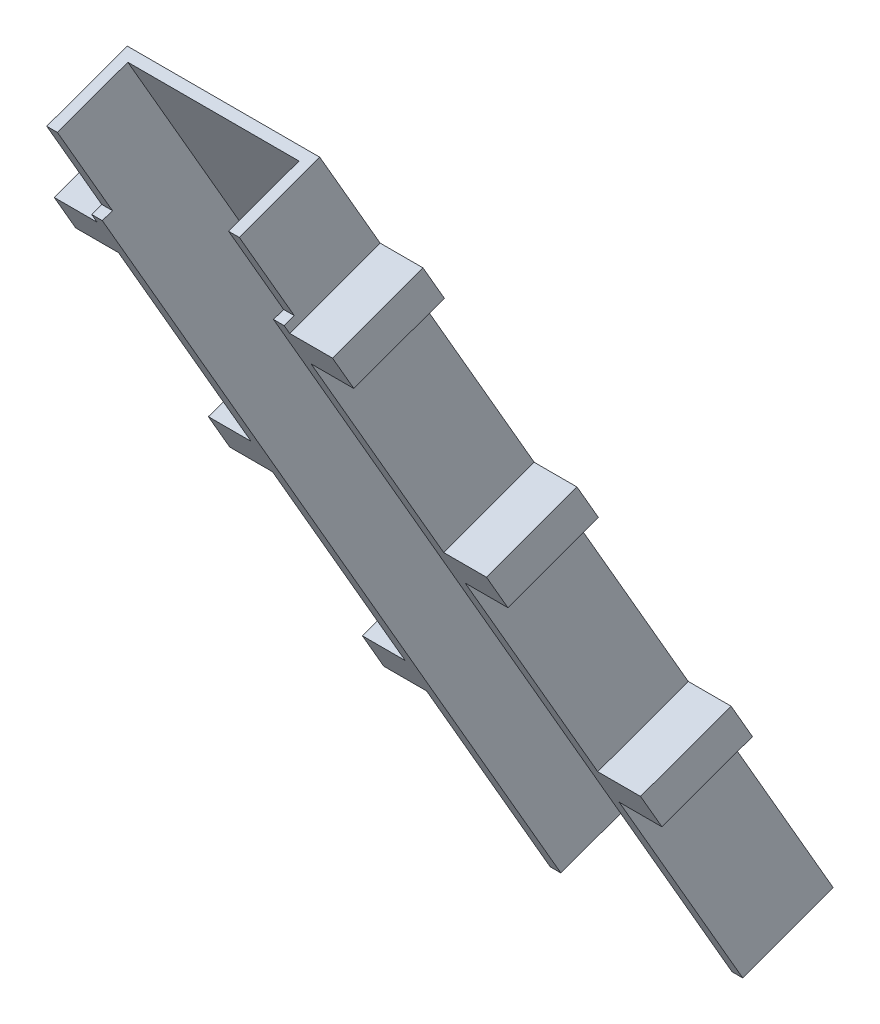
ISO-10303-21;
HEADER;
FILE_DESCRIPTION(('STEP AP214'),'2;1');
FILE_NAME('part.step','',(''),(''),'','','');
FILE_SCHEMA(('AUTOMOTIVE_DESIGN { 1 0 10303 214 1 1 1 1 }'));
ENDSEC;
DATA;
#1=APPLICATION_CONTEXT('core data for automotive mechanical design processes');
#2=APPLICATION_PROTOCOL_DEFINITION('international standard','automotive_design',2000,#1);
#3=PRODUCT_CONTEXT('',#1,'mechanical');
#4=PRODUCT('Part','Part','',(#3));
#5=PRODUCT_RELATED_PRODUCT_CATEGORY('part','',(#4));
#6=PRODUCT_DEFINITION_FORMATION('','',#4);
#7=PRODUCT_DEFINITION_CONTEXT('part definition',#1,'design');
#8=PRODUCT_DEFINITION('design','',#6,#7);
#9=PRODUCT_DEFINITION_SHAPE('','',#8);
#10=(LENGTH_UNIT() NAMED_UNIT(*) SI_UNIT(.MILLI.,.METRE.));
#11=(NAMED_UNIT(*) PLANE_ANGLE_UNIT() SI_UNIT($,.RADIAN.));
#12=(NAMED_UNIT(*) SI_UNIT($,.STERADIAN.) SOLID_ANGLE_UNIT());
#13=UNCERTAINTY_MEASURE_WITH_UNIT(LENGTH_MEASURE(1.E-05),#10,'distance_accuracy_value','');
#14=(GEOMETRIC_REPRESENTATION_CONTEXT(3) GLOBAL_UNCERTAINTY_ASSIGNED_CONTEXT((#13)) GLOBAL_UNIT_ASSIGNED_CONTEXT((#10,
#11,#12)) REPRESENTATION_CONTEXT('',''));
#15=CARTESIAN_POINT('',(0.,0.,0.));
#16=DIRECTION('',(0.,0.,1.));
#17=DIRECTION('',(1.,0.,0.));
#18=AXIS2_PLACEMENT_3D('',#15,#16,#17);
#19=CARTESIAN_POINT('',(0.,0.,0.));
#20=DIRECTION('',(-1.,0.,0.));
#21=DIRECTION('',(0.,0.,1.));
#22=AXIS2_PLACEMENT_3D('',#19,#20,#21);
#23=PLANE('',#22);
#24=DIRECTION('',(0.,0.866025403784438,0.5));
#25=VECTOR('',#24,1.);
#26=CARTESIAN_POINT('',(0.,118.941146080449,65.0602259220047));
#27=LINE('',#26,#25);
#28=CARTESIAN_POINT('',(0.,77.9504405484296,41.3942310488204));
#29=VERTEX_POINT('',#28);
#30=CARTESIAN_POINT('',(0.,112.045860695423,61.0792310488204));
#31=VERTEX_POINT('',#30);
#32=EDGE_CURVE('E671',#29,#31,#27,.T.);
#33=ORIENTED_EDGE('',*,*,#32,.T.);
#34=DIRECTION('',(0.,0.342020143325667,-0.939692620785909));
#35=VECTOR('',#34,1.);
#36=CARTESIAN_POINT('',(0.,116.932473493188,47.6533727293417));
#37=LINE('',#36,#35);
#38=CARTESIAN_POINT('',(0.,116.932473493188,47.6533727293417));
#39=VERTEX_POINT('',#38);
#40=EDGE_CURVE('E281',#31,#39,#37,.T.);
#41=ORIENTED_EDGE('',*,*,#40,.T.);
#42=DIRECTION('',(0.,0.866025403784438,0.500000000000001));
#43=VECTOR('',#42,1.);
#44=CARTESIAN_POINT('',(0.,137.954798289573,59.7906176095263));
#45=LINE('',#44,#43);
#46=CARTESIAN_POINT('',(0.,82.8370533461951,27.9683727293417));
#47=VERTEX_POINT('',#46);
#48=EDGE_CURVE('E667',#47,#39,#45,.T.);
#49=ORIENTED_EDGE('',*,*,#48,.F.);
#50=DIRECTION('',(0.,-0.342020143325669,0.939692620785908));
#51=VECTOR('',#50,1.);
#52=CARTESIAN_POINT('',(0.,77.9504405484296,41.3942310488204));
#53=LINE('',#52,#51);
#54=EDGE_CURVE('E308',#47,#29,#53,.T.);
#55=ORIENTED_EDGE('',*,*,#54,.T.);
#56=EDGE_LOOP('',(#33,#41,#49,#55));
#57=FACE_BOUND('',#56,.T.);
#58=ADVANCED_FACE('F34',(#57),#23,.T.);
#59=CARTESIAN_POINT('',(0.,122.43173480722,50.8283727293417));
#60=VERTEX_POINT('',#59);
#61=CARTESIAN_POINT('',(0.,137.954798289573,59.7906176095263));
#62=VERTEX_POINT('',#61);
#63=EDGE_CURVE('E516',#60,#62,#45,.T.);
#64=ORIENTED_EDGE('',*,*,#63,.F.);
#65=DIRECTION('',(0.,-0.342020143325668,0.939692620785909));
#66=VECTOR('',#65,1.);
#67=CARTESIAN_POINT('',(0.,117.545122009454,64.2542310488204));
#68=LINE('',#67,#66);
#69=CARTESIAN_POINT('',(0.,117.545122009454,64.2542310488204));
#70=VERTEX_POINT('',#69);
#71=EDGE_CURVE('E291',#60,#70,#68,.T.);
#72=ORIENTED_EDGE('',*,*,#71,.T.);
#73=CARTESIAN_POINT('',(0.,118.941146080449,65.0602259220047));
#74=VERTEX_POINT('',#73);
#75=EDGE_CURVE('E442',#70,#74,#27,.T.);
#76=ORIENTED_EDGE('',*,*,#75,.T.);
#77=DIRECTION('',(0.,0.342020143325666,-0.939692620785909));
#78=VECTOR('',#77,1.);
#79=CARTESIAN_POINT('',(0.,119.484103057979,63.5684638865073));
#80=LINE('',#79,#78);
#81=CARTESIAN_POINT('',(0.,119.484103057979,63.5684638865073));
#82=VERTEX_POINT('',#81);
#83=EDGE_CURVE('E460',#74,#82,#80,.T.);
#84=ORIENTED_EDGE('',*,*,#83,.T.);
#85=DIRECTION('',(0.,0.866025403784439,0.499999999999999));
#86=VECTOR('',#85,1.);
#87=CARTESIAN_POINT('',(0.,133.611142469337,71.7247138935073));
#88=LINE('',#87,#86);
#89=CARTESIAN_POINT('',(0.,133.611142469337,71.7247138935073));
#90=VERTEX_POINT('',#89);
#91=EDGE_CURVE('E462',#82,#90,#88,.T.);
#92=ORIENTED_EDGE('',*,*,#91,.T.);
#93=DIRECTION('',(0.,-0.342020143325666,0.939692620785909));
#94=VECTOR('',#93,1.);
#95=CARTESIAN_POINT('',(0.,131.982271536748,76.2000000000002));
#96=LINE('',#95,#94);
#97=EDGE_CURVE('E507',#62,#90,#96,.T.);
#98=ORIENTED_EDGE('',*,*,#97,.F.);
#99=EDGE_LOOP('',(#64,#72,#76,#84,#92,#98));
#100=FACE_BOUND('',#99,.T.);
#101=ADVANCED_FACE('F558',(#100),#23,.T.);
#102=CARTESIAN_POINT('',(0.,38.3557590874051,18.5342310488204));
#103=VERTEX_POINT('',#102);
#104=CARTESIAN_POINT('',(0.,72.4511792343985,38.2192310488204));
#105=VERTEX_POINT('',#104);
#106=EDGE_CURVE('E441',#103,#105,#27,.T.);
#107=ORIENTED_EDGE('',*,*,#106,.T.);
#108=DIRECTION('',(0.,0.342020143325669,-0.939692620785908));
#109=VECTOR('',#108,1.);
#110=CARTESIAN_POINT('',(0.,77.337792032164,24.7933727293417));
#111=LINE('',#110,#109);
#112=CARTESIAN_POINT('',(0.,77.337792032164,24.7933727293417));
#113=VERTEX_POINT('',#112);
#114=EDGE_CURVE('E285',#105,#113,#111,.T.);
#115=ORIENTED_EDGE('',*,*,#114,.T.);
#116=CARTESIAN_POINT('',(0.,43.2423718851706,5.10837272934177));
#117=VERTEX_POINT('',#116);
#118=EDGE_CURVE('E520',#117,#113,#45,.T.);
#119=ORIENTED_EDGE('',*,*,#118,.F.);
#120=DIRECTION('',(0.,-0.34202014332567,0.939692620785908));
#121=VECTOR('',#120,1.);
#122=CARTESIAN_POINT('',(0.,38.3557590874051,18.5342310488204));
#123=LINE('',#122,#121);
#124=EDGE_CURVE('E333',#117,#103,#123,.T.);
#125=ORIENTED_EDGE('',*,*,#124,.T.);
#126=EDGE_LOOP('',(#107,#115,#119,#125));
#127=FACE_BOUND('',#126,.T.);
#128=ADVANCED_FACE('F638',(#127),#23,.T.);
#129=CARTESIAN_POINT('',(0.,1.085913955059,-2.98352407099529));
#130=VERTEX_POINT('',#129);
#131=CARTESIAN_POINT('',(0.,32.8564977733739,15.3592310488204));
#132=VERTEX_POINT('',#131);
#133=EDGE_CURVE('E437',#130,#132,#27,.T.);
#134=ORIENTED_EDGE('',*,*,#133,.T.);
#135=DIRECTION('',(0.,0.342020143325669,-0.939692620785908));
#136=VECTOR('',#135,1.);
#137=CARTESIAN_POINT('',(0.,37.7431105711394,1.93337272934176));
#138=LINE('',#137,#136);
#139=CARTESIAN_POINT('',(0.,37.7431105711394,1.93337272934176));
#140=VERTEX_POINT('',#139);
#141=EDGE_CURVE('E328',#132,#140,#138,.T.);
#142=ORIENTED_EDGE('',*,*,#141,.T.);
#143=CARTESIAN_POINT('',(0.,5.97252675282446,-16.409382390474));
#144=VERTEX_POINT('',#143);
#145=EDGE_CURVE('E517',#144,#140,#45,.T.);
#146=ORIENTED_EDGE('',*,*,#145,.F.);
#147=DIRECTION('',(0.,0.342020143325666,-0.939692620785909));
#148=VECTOR('',#147,1.);
#149=CARTESIAN_POINT('',(0.,5.97252675282446,-16.409382390474));
#150=LINE('',#149,#148);
#151=EDGE_CURVE('E503',#130,#144,#150,.T.);
#152=ORIENTED_EDGE('',*,*,#151,.F.);
#153=EDGE_LOOP('',(#134,#142,#146,#152));
#154=FACE_BOUND('',#153,.T.);
#155=ADVANCED_FACE('F634',(#154),#23,.T.);
#156=CARTESIAN_POINT('',(28.575,0.,0.));
#157=DIRECTION('',(-1.,0.,0.));
#158=DIRECTION('',(0.,0.,1.));
#159=AXIS2_PLACEMENT_3D('',#156,#157,#158);
#160=PLANE('',#159);
#161=DIRECTION('',(0.,-0.34202014332567,0.939692620785908));
#162=VECTOR('',#161,1.);
#163=CARTESIAN_POINT('',(28.575,38.3557590874051,18.5342310488204));
#164=LINE('',#163,#162);
#165=CARTESIAN_POINT('',(28.575,43.2423718851706,5.10837272934182));
#166=VERTEX_POINT('',#165);
#167=CARTESIAN_POINT('',(28.575,38.3557590874051,18.5342310488204));
#168=VERTEX_POINT('',#167);
#169=EDGE_CURVE('E360',#166,#168,#164,.T.);
#170=ORIENTED_EDGE('',*,*,#169,.F.);
#171=DIRECTION('',(0.,0.866025403784438,0.500000000000001));
#172=VECTOR('',#171,1.);
#173=CARTESIAN_POINT('',(28.575,137.954798289573,59.7906176095263));
#174=LINE('',#173,#172);
#175=CARTESIAN_POINT('',(28.575,77.337792032164,24.7933727293417));
#176=VERTEX_POINT('',#175);
#177=EDGE_CURVE('E511',#166,#176,#174,.T.);
#178=ORIENTED_EDGE('',*,*,#177,.T.);
#179=DIRECTION('',(0.,0.342020143325669,-0.939692620785908));
#180=VECTOR('',#179,1.);
#181=CARTESIAN_POINT('',(28.575,77.337792032164,24.7933727293417));
#182=LINE('',#181,#180);
#183=CARTESIAN_POINT('',(28.575,72.4511792343985,38.2192310488204));
#184=VERTEX_POINT('',#183);
#185=EDGE_CURVE('E382',#184,#176,#182,.T.);
#186=ORIENTED_EDGE('',*,*,#185,.F.);
#187=DIRECTION('',(0.,0.866025403784438,0.5));
#188=VECTOR('',#187,1.);
#189=CARTESIAN_POINT('',(28.575,118.941146080449,65.0602259220047));
#190=LINE('',#189,#188);
#191=EDGE_CURVE('E446',#168,#184,#190,.T.);
#192=ORIENTED_EDGE('',*,*,#191,.F.);
#193=EDGE_LOOP('',(#170,#178,#186,#192));
#194=FACE_BOUND('',#193,.T.);
#195=ADVANCED_FACE('F599',(#194),#160,.F.);
#196=DIRECTION('',(0.,0.342020143325669,-0.939692620785908));
#197=VECTOR('',#196,1.);
#198=CARTESIAN_POINT('',(28.575,37.7431105711394,1.93337272934176));
#199=LINE('',#198,#197);
#200=CARTESIAN_POINT('',(28.575,32.8564977733739,15.3592310488204));
#201=VERTEX_POINT('',#200);
#202=CARTESIAN_POINT('',(28.575,37.7431105711394,1.93337272934176));
#203=VERTEX_POINT('',#202);
#204=EDGE_CURVE('E355',#201,#203,#199,.T.);
#205=ORIENTED_EDGE('',*,*,#204,.F.);
#206=CARTESIAN_POINT('',(28.575,1.085913955059,-2.98352407099529));
#207=VERTEX_POINT('',#206);
#208=EDGE_CURVE('E443',#207,#201,#190,.T.);
#209=ORIENTED_EDGE('',*,*,#208,.F.);
#210=DIRECTION('',(0.,0.342020143325666,-0.939692620785909));
#211=VECTOR('',#210,1.);
#212=CARTESIAN_POINT('',(28.575,5.97252675282446,-16.409382390474));
#213=LINE('',#212,#211);
#214=CARTESIAN_POINT('',(28.575,5.97252675282446,-16.409382390474));
#215=VERTEX_POINT('',#214);
#216=EDGE_CURVE('E504',#207,#215,#213,.T.);
#217=ORIENTED_EDGE('',*,*,#216,.T.);
#218=EDGE_CURVE('E508',#215,#203,#174,.T.);
#219=ORIENTED_EDGE('',*,*,#218,.T.);
#220=EDGE_LOOP('',(#205,#209,#217,#219));
#221=FACE_BOUND('',#220,.T.);
#222=ADVANCED_FACE('F581',(#221),#160,.F.);
#223=DIRECTION('',(0.,-0.342020143325669,0.939692620785908));
#224=VECTOR('',#223,1.);
#225=CARTESIAN_POINT('',(28.575,77.9504405484296,41.3942310488204));
#226=LINE('',#225,#224);
#227=CARTESIAN_POINT('',(28.575,82.8370533461951,27.9683727293419));
#228=VERTEX_POINT('',#227);
#229=CARTESIAN_POINT('',(28.575,77.9504405484296,41.3942310488204));
#230=VERTEX_POINT('',#229);
#231=EDGE_CURVE('E387',#228,#230,#226,.T.);
#232=ORIENTED_EDGE('',*,*,#231,.F.);
#233=CARTESIAN_POINT('',(28.575,116.932473493188,47.6533727293417));
#234=VERTEX_POINT('',#233);
#235=EDGE_CURVE('E553',#228,#234,#174,.T.);
#236=ORIENTED_EDGE('',*,*,#235,.T.);
#237=DIRECTION('',(0.,0.342020143325667,-0.939692620785909));
#238=VECTOR('',#237,1.);
#239=CARTESIAN_POINT('',(28.575,116.932473493188,47.6533727293417));
#240=LINE('',#239,#238);
#241=CARTESIAN_POINT('',(28.575,112.045860695423,61.0792310488204));
#242=VERTEX_POINT('',#241);
#243=EDGE_CURVE('E409',#242,#234,#240,.T.);
#244=ORIENTED_EDGE('',*,*,#243,.F.);
#245=EDGE_CURVE('E617',#230,#242,#190,.T.);
#246=ORIENTED_EDGE('',*,*,#245,.F.);
#247=EDGE_LOOP('',(#232,#236,#244,#246));
#248=FACE_BOUND('',#247,.T.);
#249=ADVANCED_FACE('F605',(#248),#160,.F.);
#250=DIRECTION('',(0.,-0.342020143325668,0.939692620785909));
#251=VECTOR('',#250,1.);
#252=CARTESIAN_POINT('',(28.575,117.545122009454,64.2542310488204));
#253=LINE('',#252,#251);
#254=CARTESIAN_POINT('',(28.575,122.43173480722,50.828372729342));
#255=VERTEX_POINT('',#254);
#256=CARTESIAN_POINT('',(28.575,117.545122009454,64.2542310488204));
#257=VERTEX_POINT('',#256);
#258=EDGE_CURVE('E414',#255,#257,#253,.T.);
#259=ORIENTED_EDGE('',*,*,#258,.F.);
#260=CARTESIAN_POINT('',(28.575,137.954798289573,59.7906176095263));
#261=VERTEX_POINT('',#260);
#262=EDGE_CURVE('E506',#255,#261,#174,.T.);
#263=ORIENTED_EDGE('',*,*,#262,.T.);
#264=DIRECTION('',(0.,-0.342020143325666,0.939692620785909));
#265=VECTOR('',#264,1.);
#266=CARTESIAN_POINT('',(28.575,131.982271536748,76.2000000000002));
#267=LINE('',#266,#265);
#268=CARTESIAN_POINT('',(28.575,133.611142469337,71.7247138935073));
#269=VERTEX_POINT('',#268);
#270=EDGE_CURVE('E510',#261,#269,#267,.T.);
#271=ORIENTED_EDGE('',*,*,#270,.T.);
#272=DIRECTION('',(0.,0.866025403784439,0.499999999999999));
#273=VECTOR('',#272,1.);
#274=CARTESIAN_POINT('',(28.575,133.611142469337,71.7247138935073));
#275=LINE('',#274,#273);
#276=CARTESIAN_POINT('',(28.575,119.484103057979,63.5684638865073));
#277=VERTEX_POINT('',#276);
#278=EDGE_CURVE('E463',#277,#269,#275,.T.);
#279=ORIENTED_EDGE('',*,*,#278,.F.);
#280=DIRECTION('',(0.,0.342020143325666,-0.939692620785909));
#281=VECTOR('',#280,1.);
#282=CARTESIAN_POINT('',(28.575,119.484103057979,63.5684638865073));
#283=LINE('',#282,#281);
#284=CARTESIAN_POINT('',(28.575,118.941146080449,65.0602259220047));
#285=VERTEX_POINT('',#284);
#286=EDGE_CURVE('E459',#285,#277,#283,.T.);
#287=ORIENTED_EDGE('',*,*,#286,.F.);
#288=EDGE_CURVE('E436',#257,#285,#190,.T.);
#289=ORIENTED_EDGE('',*,*,#288,.F.);
#290=EDGE_LOOP('',(#259,#263,#271,#279,#287,#289));
#291=FACE_BOUND('',#290,.T.);
#292=ADVANCED_FACE('F548',(#291),#160,.F.);
#293=CARTESIAN_POINT('',(28.575,5.97252675282446,-16.409382390474));
#294=DIRECTION('',(0.,0.939692620785909,0.342020143325667));
#295=DIRECTION('',(0.,-0.342020143325667,0.939692620785909));
#296=AXIS2_PLACEMENT_3D('',#293,#294,#295);
#297=PLANE('',#296);
#298=ORIENTED_EDGE('',*,*,#216,.F.);
#299=DIRECTION('',(1.,0.,0.));
#300=VECTOR('',#299,1.);
#301=CARTESIAN_POINT('',(0.,1.085913955059,-2.98352407099529));
#302=LINE('',#301,#300);
#303=CARTESIAN_POINT('',(26.9875,1.085913955059,-2.98352407099529));
#304=VERTEX_POINT('',#303);
#305=EDGE_CURVE('E440',#304,#207,#302,.T.);
#306=ORIENTED_EDGE('',*,*,#305,.F.);
#307=DIRECTION('',(0.,0.342020143325667,-0.939692620785909));
#308=VECTOR('',#307,1.);
#309=CARTESIAN_POINT('',(26.9875,5.97252675282446,-16.409382390474));
#310=LINE('',#309,#308);
#311=CARTESIAN_POINT('',(26.9875,5.42956977529497,-14.9176203549763));
#312=VERTEX_POINT('',#311);
#313=EDGE_CURVE('E493',#304,#312,#310,.T.);
#314=ORIENTED_EDGE('',*,*,#313,.T.);
#315=DIRECTION('',(-1.,0.,0.));
#316=VECTOR('',#315,1.);
#317=CARTESIAN_POINT('',(28.575,5.42956977529497,-14.9176203549763));
#318=LINE('',#317,#316);
#319=CARTESIAN_POINT('',(1.5875,5.42956977529497,-14.9176203549763));
#320=VERTEX_POINT('',#319);
#321=EDGE_CURVE('E497',#312,#320,#318,.T.);
#322=ORIENTED_EDGE('',*,*,#321,.T.);
#323=DIRECTION('',(0.,-0.342020143325667,0.939692620785909));
#324=VECTOR('',#323,1.);
#325=CARTESIAN_POINT('',(1.5875,5.97252675282446,-16.409382390474));
#326=LINE('',#325,#324);
#327=CARTESIAN_POINT('',(1.5875,1.085913955059,-2.98352407099529));
#328=VERTEX_POINT('',#327);
#329=EDGE_CURVE('E500',#320,#328,#326,.T.);
#330=ORIENTED_EDGE('',*,*,#329,.T.);
#331=EDGE_CURVE('E452',#130,#328,#302,.T.);
#332=ORIENTED_EDGE('',*,*,#331,.F.);
#333=ORIENTED_EDGE('',*,*,#151,.T.);
#334=DIRECTION('',(-1.,0.,0.));
#335=VECTOR('',#334,1.);
#336=CARTESIAN_POINT('',(28.575,5.97252675282446,-16.409382390474));
#337=LINE('',#336,#335);
#338=EDGE_CURVE('E525',#215,#144,#337,.T.);
#339=ORIENTED_EDGE('',*,*,#338,.F.);
#340=EDGE_LOOP('',(#298,#306,#314,#322,#330,#332,#333,#339));
#341=FACE_BOUND('',#340,.T.);
#342=ADVANCED_FACE('F36',(#341),#297,.F.);
#343=CARTESIAN_POINT('',(28.575,137.954798289573,59.7906176095263));
#344=DIRECTION('',(0.,-0.500000000000002,0.866025403784438));
#345=DIRECTION('',(0.,-0.866025403784438,-0.500000000000001));
#346=AXIS2_PLACEMENT_3D('',#343,#344,#345);
#347=PLANE('',#346);
#348=ORIENTED_EDGE('',*,*,#145,.T.);
#349=DIRECTION('',(1.,0.,0.));
#350=VECTOR('',#349,1.);
#351=CARTESIAN_POINT('',(-6.35,37.7431105711394,1.93337272934176));
#352=LINE('',#351,#350);
#353=CARTESIAN_POINT('',(-6.35,37.7431105711394,1.93337272934176));
#354=VERTEX_POINT('',#353);
#355=EDGE_CURVE('E350',#354,#140,#352,.T.);
#356=ORIENTED_EDGE('',*,*,#355,.F.);
#357=DIRECTION('',(0.,0.866025403784438,0.500000000000001));
#358=VECTOR('',#357,1.);
#359=CARTESIAN_POINT('',(-6.35,43.2423718851706,5.10837272934177));
#360=LINE('',#359,#358);
#361=CARTESIAN_POINT('',(-6.35,43.2423718851706,5.10837272934177));
#362=VERTEX_POINT('',#361);
#363=EDGE_CURVE('E336',#354,#362,#360,.T.);
#364=ORIENTED_EDGE('',*,*,#363,.T.);
#365=DIRECTION('',(1.,0.,0.));
#366=VECTOR('',#365,1.);
#367=CARTESIAN_POINT('',(-6.35,43.2423718851706,5.10837272934177));
#368=LINE('',#367,#366);
#369=EDGE_CURVE('E347',#362,#117,#368,.T.);
#370=ORIENTED_EDGE('',*,*,#369,.T.);
#371=ORIENTED_EDGE('',*,*,#118,.T.);
#372=DIRECTION('',(1.,0.,0.));
#373=VECTOR('',#372,1.);
#374=CARTESIAN_POINT('',(-6.35,77.337792032164,24.7933727293417));
#375=LINE('',#374,#373);
#376=CARTESIAN_POINT('',(-6.35,77.337792032164,24.7933727293417));
#377=VERTEX_POINT('',#376);
#378=EDGE_CURVE('E323',#377,#113,#375,.T.);
#379=ORIENTED_EDGE('',*,*,#378,.F.);
#380=DIRECTION('',(0.,0.866025403784438,0.500000000000002));
#381=VECTOR('',#380,1.);
#382=CARTESIAN_POINT('',(-6.35,82.8370533461951,27.9683727293417));
#383=LINE('',#382,#381);
#384=CARTESIAN_POINT('',(-6.35,82.8370533461951,27.9683727293417));
#385=VERTEX_POINT('',#384);
#386=EDGE_CURVE('E311',#377,#385,#383,.T.);
#387=ORIENTED_EDGE('',*,*,#386,.T.);
#388=DIRECTION('',(1.,0.,0.));
#389=VECTOR('',#388,1.);
#390=CARTESIAN_POINT('',(-6.35,82.8370533461951,27.9683727293417));
#391=LINE('',#390,#389);
#392=EDGE_CURVE('E320',#385,#47,#391,.T.);
#393=ORIENTED_EDGE('',*,*,#392,.T.);
#394=ORIENTED_EDGE('',*,*,#48,.T.);
#395=DIRECTION('',(1.,0.,0.));
#396=VECTOR('',#395,1.);
#397=CARTESIAN_POINT('',(-6.35,116.932473493188,47.6533727293417));
#398=LINE('',#397,#396);
#399=CARTESIAN_POINT('',(-6.35,116.932473493188,47.6533727293417));
#400=VERTEX_POINT('',#399);
#401=EDGE_CURVE('E286',#400,#39,#398,.T.);
#402=ORIENTED_EDGE('',*,*,#401,.F.);
#403=DIRECTION('',(0.,0.866025403784438,0.500000000000001));
#404=VECTOR('',#403,1.);
#405=CARTESIAN_POINT('',(-6.35,122.43173480722,50.8283727293417));
#406=LINE('',#405,#404);
#407=CARTESIAN_POINT('',(-6.35,122.43173480722,50.8283727293417));
#408=VERTEX_POINT('',#407);
#409=EDGE_CURVE('E273',#400,#408,#406,.T.);
#410=ORIENTED_EDGE('',*,*,#409,.T.);
#411=DIRECTION('',(1.,0.,0.));
#412=VECTOR('',#411,1.);
#413=CARTESIAN_POINT('',(-6.35,122.43173480722,50.8283727293417));
#414=LINE('',#413,#412);
#415=EDGE_CURVE('E300',#408,#60,#414,.T.);
#416=ORIENTED_EDGE('',*,*,#415,.T.);
#417=ORIENTED_EDGE('',*,*,#63,.T.);
#418=DIRECTION('',(-1.,0.,0.));
#419=VECTOR('',#418,1.);
#420=CARTESIAN_POINT('',(28.575,137.954798289573,59.7906176095263));
#421=LINE('',#420,#419);
#422=EDGE_CURVE('E514',#261,#62,#421,.T.);
#423=ORIENTED_EDGE('',*,*,#422,.F.);
#424=ORIENTED_EDGE('',*,*,#262,.F.);
#425=DIRECTION('',(-1.,0.,0.));
#426=VECTOR('',#425,1.);
#427=CARTESIAN_POINT('',(34.925,122.43173480722,50.8283727293417));
#428=LINE('',#427,#426);
#429=CARTESIAN_POINT('',(34.925,122.43173480722,50.8283727293417));
#430=VERTEX_POINT('',#429);
#431=EDGE_CURVE('E427',#430,#255,#428,.T.);
#432=ORIENTED_EDGE('',*,*,#431,.F.);
#433=DIRECTION('',(0.,0.866025403784438,0.500000000000001));
#434=VECTOR('',#433,1.);
#435=CARTESIAN_POINT('',(34.925,122.43173480722,50.8283727293417));
#436=LINE('',#435,#434);
#437=CARTESIAN_POINT('',(34.925,116.932473493188,47.6533727293417));
#438=VERTEX_POINT('',#437);
#439=EDGE_CURVE('E416',#438,#430,#436,.T.);
#440=ORIENTED_EDGE('',*,*,#439,.F.);
#441=DIRECTION('',(-1.,0.,0.));
#442=VECTOR('',#441,1.);
#443=CARTESIAN_POINT('',(34.925,116.932473493188,47.6533727293417));
#444=LINE('',#443,#442);
#445=EDGE_CURVE('E430',#438,#234,#444,.T.);
#446=ORIENTED_EDGE('',*,*,#445,.T.);
#447=ORIENTED_EDGE('',*,*,#235,.F.);
#448=DIRECTION('',(-1.,0.,0.));
#449=VECTOR('',#448,1.);
#450=CARTESIAN_POINT('',(34.925,82.8370533461951,27.9683727293417));
#451=LINE('',#450,#449);
#452=CARTESIAN_POINT('',(34.925,82.8370533461951,27.9683727293417));
#453=VERTEX_POINT('',#452);
#454=EDGE_CURVE('E400',#453,#228,#451,.T.);
#455=ORIENTED_EDGE('',*,*,#454,.F.);
#456=DIRECTION('',(0.,0.866025403784438,0.500000000000002));
#457=VECTOR('',#456,1.);
#458=CARTESIAN_POINT('',(34.925,82.8370533461951,27.9683727293417));
#459=LINE('',#458,#457);
#460=CARTESIAN_POINT('',(34.925,77.337792032164,24.7933727293417));
#461=VERTEX_POINT('',#460);
#462=EDGE_CURVE('E389',#461,#453,#459,.T.);
#463=ORIENTED_EDGE('',*,*,#462,.F.);
#464=DIRECTION('',(-1.,0.,0.));
#465=VECTOR('',#464,1.);
#466=CARTESIAN_POINT('',(34.925,77.337792032164,24.7933727293417));
#467=LINE('',#466,#465);
#468=EDGE_CURVE('E403',#461,#176,#467,.T.);
#469=ORIENTED_EDGE('',*,*,#468,.T.);
#470=ORIENTED_EDGE('',*,*,#177,.F.);
#471=DIRECTION('',(-1.,0.,0.));
#472=VECTOR('',#471,1.);
#473=CARTESIAN_POINT('',(34.925,43.2423718851706,5.10837272934177));
#474=LINE('',#473,#472);
#475=CARTESIAN_POINT('',(34.925,43.2423718851706,5.10837272934177));
#476=VERTEX_POINT('',#475);
#477=EDGE_CURVE('E373',#476,#166,#474,.T.);
#478=ORIENTED_EDGE('',*,*,#477,.F.);
#479=DIRECTION('',(0.,0.866025403784438,0.500000000000001));
#480=VECTOR('',#479,1.);
#481=CARTESIAN_POINT('',(34.925,43.2423718851706,5.10837272934177));
#482=LINE('',#481,#480);
#483=CARTESIAN_POINT('',(34.925,37.7431105711394,1.93337272934176));
#484=VERTEX_POINT('',#483);
#485=EDGE_CURVE('E362',#484,#476,#482,.T.);
#486=ORIENTED_EDGE('',*,*,#485,.F.);
#487=DIRECTION('',(-1.,0.,0.));
#488=VECTOR('',#487,1.);
#489=CARTESIAN_POINT('',(34.925,37.7431105711394,1.93337272934176));
#490=LINE('',#489,#488);
#491=EDGE_CURVE('E376',#484,#203,#490,.T.);
#492=ORIENTED_EDGE('',*,*,#491,.T.);
#493=ORIENTED_EDGE('',*,*,#218,.F.);
#494=ORIENTED_EDGE('',*,*,#338,.T.);
#495=EDGE_LOOP('',(#348,#356,#364,#370,#371,#379,#387,#393,#394,#402,#410,#416,#417,#423,#424,
#432,#440,#446,#447,#455,#463,#469,#470,#478,#486,#492,#493,#494));
#496=FACE_BOUND('',#495,.T.);
#497=ADVANCED_FACE('F554',(#496),#347,.F.);
#498=CARTESIAN_POINT('',(28.575,131.982271536748,76.2000000000002));
#499=DIRECTION('',(0.,-0.939692620785909,-0.342020143325666));
#500=DIRECTION('',(0.,0.342020143325666,-0.939692620785909));
#501=AXIS2_PLACEMENT_3D('',#498,#499,#500);
#502=PLANE('',#501);
#503=ORIENTED_EDGE('',*,*,#97,.T.);
#504=DIRECTION('',(1.,0.,0.));
#505=VECTOR('',#504,1.);
#506=CARTESIAN_POINT('',(0.,133.611142469337,71.7247138935073));
#507=LINE('',#506,#505);
#508=CARTESIAN_POINT('',(1.5875,133.611142469337,71.7247138935073));
#509=VERTEX_POINT('',#508);
#510=EDGE_CURVE('E469',#90,#509,#507,.T.);
#511=ORIENTED_EDGE('',*,*,#510,.T.);
#512=DIRECTION('',(0.,-0.342020143325665,0.93969262078591));
#513=VECTOR('',#512,1.);
#514=CARTESIAN_POINT('',(1.5875,137.411841312043,61.2823796450239));
#515=LINE('',#514,#513);
#516=CARTESIAN_POINT('',(1.5875,137.411841312043,61.2823796450239));
#517=VERTEX_POINT('',#516);
#518=EDGE_CURVE('E482',#517,#509,#515,.T.);
#519=ORIENTED_EDGE('',*,*,#518,.F.);
#520=DIRECTION('',(-1.,0.,0.));
#521=VECTOR('',#520,1.);
#522=CARTESIAN_POINT('',(1.5875,137.411841312043,61.2823796450239));
#523=LINE('',#522,#521);
#524=CARTESIAN_POINT('',(26.9875,137.411841312043,61.2823796450239));
#525=VERTEX_POINT('',#524);
#526=EDGE_CURVE('E487',#525,#517,#523,.T.);
#527=ORIENTED_EDGE('',*,*,#526,.F.);
#528=DIRECTION('',(0.,0.342020143325665,-0.93969262078591));
#529=VECTOR('',#528,1.);
#530=CARTESIAN_POINT('',(26.9875,137.411841312043,61.2823796450239));
#531=LINE('',#530,#529);
#532=CARTESIAN_POINT('',(26.9875,133.611142469337,71.7247138935073));
#533=VERTEX_POINT('',#532);
#534=EDGE_CURVE('E485',#533,#525,#531,.T.);
#535=ORIENTED_EDGE('',*,*,#534,.F.);
#536=EDGE_CURVE('E473',#533,#269,#507,.T.);
#537=ORIENTED_EDGE('',*,*,#536,.T.);
#538=ORIENTED_EDGE('',*,*,#270,.F.);
#539=ORIENTED_EDGE('',*,*,#422,.T.);
#540=EDGE_LOOP('',(#503,#511,#519,#527,#535,#537,#538,#539));
#541=FACE_BOUND('',#540,.T.);
#542=ADVANCED_FACE('F545',(#541),#502,.F.);
#543=CARTESIAN_POINT('',(1.5875,-1.43716705356287,-18.8821327115717));
#544=DIRECTION('',(-1.,0.,0.));
#545=DIRECTION('',(0.,0.,1.));
#546=AXIS2_PLACEMENT_3D('',#543,#544,#545);
#547=PLANE('',#546);
#548=DIRECTION('',(0.,-0.342020143325666,0.939692620785909));
#549=VECTOR('',#548,1.);
#550=CARTESIAN_POINT('',(1.5875,131.83811246638,29.626101997195));
#551=LINE('',#550,#549);
#552=CARTESIAN_POINT('',(1.5875,119.484103057979,63.5684638865073));
#553=VERTEX_POINT('',#552);
#554=CARTESIAN_POINT('',(1.5875,118.941146080449,65.0602259220047));
#555=VERTEX_POINT('',#554);
#556=EDGE_CURVE('E472',#553,#555,#551,.T.);
#557=ORIENTED_EDGE('',*,*,#556,.T.);
#558=DIRECTION('',(0.,-0.866025403784438,-0.5));
#559=VECTOR('',#558,1.);
#560=CARTESIAN_POINT('',(1.5875,-7.6906962851904,-8.0507023557757));
#561=LINE('',#560,#559);
#562=EDGE_CURVE('E456',#555,#328,#561,.T.);
#563=ORIENTED_EDGE('',*,*,#562,.T.);
#564=ORIENTED_EDGE('',*,*,#329,.F.);
#565=DIRECTION('',(0.,0.866025403784438,0.500000000000001));
#566=VECTOR('',#565,1.);
#567=CARTESIAN_POINT('',(1.5875,-1.43716705356287,-18.8821327115717));
#568=LINE('',#567,#566);
#569=EDGE_CURVE('E491',#320,#517,#568,.T.);
#570=ORIENTED_EDGE('',*,*,#569,.T.);
#571=ORIENTED_EDGE('',*,*,#518,.T.);
#572=DIRECTION('',(0.,-0.866025403784439,-0.499999999999999));
#573=VECTOR('',#572,1.);
#574=CARTESIAN_POINT('',(1.5875,-6.90900513123712,-9.40463115024991));
#575=LINE('',#574,#573);
#576=EDGE_CURVE('E479',#509,#553,#575,.T.);
#577=ORIENTED_EDGE('',*,*,#576,.T.);
#578=EDGE_LOOP('',(#557,#563,#564,#570,#571,#577));
#579=FACE_BOUND('',#578,.T.);
#580=ADVANCED_FACE('F566',(#579),#547,.F.);
#581=CARTESIAN_POINT('',(1.5875,-1.43716705356287,-18.8821327115717));
#582=DIRECTION('',(0.,0.500000000000001,-0.866025403784438));
#583=DIRECTION('',(0.,0.866025403784438,0.500000000000002));
#584=AXIS2_PLACEMENT_3D('',#581,#582,#583);
#585=PLANE('',#584);
#586=DIRECTION('',(0.,0.866025403784438,0.500000000000001));
#587=VECTOR('',#586,1.);
#588=CARTESIAN_POINT('',(26.9875,-1.43716705356287,-18.8821327115717));
#589=LINE('',#588,#587);
#590=EDGE_CURVE('E490',#312,#525,#589,.T.);
#591=ORIENTED_EDGE('',*,*,#590,.T.);
#592=ORIENTED_EDGE('',*,*,#526,.T.);
#593=ORIENTED_EDGE('',*,*,#569,.F.);
#594=ORIENTED_EDGE('',*,*,#321,.F.);
#595=EDGE_LOOP('',(#591,#592,#593,#594));
#596=FACE_BOUND('',#595,.T.);
#597=ADVANCED_FACE('F570',(#596),#585,.F.);
#598=CARTESIAN_POINT('',(26.9875,-1.43716705356287,-18.8821327115717));
#599=DIRECTION('',(1.,0.,0.));
#600=DIRECTION('',(0.,0.,-1.));
#601=AXIS2_PLACEMENT_3D('',#598,#599,#600);
#602=PLANE('',#601);
#603=ORIENTED_EDGE('',*,*,#313,.F.);
#604=DIRECTION('',(0.,0.866025403784438,0.5));
#605=VECTOR('',#604,1.);
#606=CARTESIAN_POINT('',(26.9875,-7.6906962851904,-8.0507023557757));
#607=LINE('',#606,#605);
#608=CARTESIAN_POINT('',(26.9875,118.941146080449,65.0602259220047));
#609=VERTEX_POINT('',#608);
#610=EDGE_CURVE('E450',#304,#609,#607,.T.);
#611=ORIENTED_EDGE('',*,*,#610,.T.);
#612=DIRECTION('',(0.,0.342020143325666,-0.939692620785909));
#613=VECTOR('',#612,1.);
#614=CARTESIAN_POINT('',(26.9875,131.83811246638,29.626101997195));
#615=LINE('',#614,#613);
#616=CARTESIAN_POINT('',(26.9875,119.484103057979,63.5684638865073));
#617=VERTEX_POINT('',#616);
#618=EDGE_CURVE('E42',#609,#617,#615,.T.);
#619=ORIENTED_EDGE('',*,*,#618,.T.);
#620=DIRECTION('',(0.,0.866025403784439,0.499999999999999));
#621=VECTOR('',#620,1.);
#622=CARTESIAN_POINT('',(26.9875,-6.90900513123712,-9.40463115024991));
#623=LINE('',#622,#621);
#624=EDGE_CURVE('E11',#617,#533,#623,.T.);
#625=ORIENTED_EDGE('',*,*,#624,.T.);
#626=ORIENTED_EDGE('',*,*,#534,.T.);
#627=ORIENTED_EDGE('',*,*,#590,.F.);
#628=EDGE_LOOP('',(#603,#611,#619,#625,#626,#627));
#629=FACE_BOUND('',#628,.T.);
#630=ADVANCED_FACE('F531',(#629),#602,.F.);
#631=CARTESIAN_POINT('',(0.,119.484103057979,63.5684638865073));
#632=DIRECTION('',(0.,-0.939692620785909,-0.342020143325666));
#633=DIRECTION('',(0.,0.342020143325666,-0.939692620785909));
#634=AXIS2_PLACEMENT_3D('',#631,#632,#633);
#635=PLANE('',#634);
#636=ORIENTED_EDGE('',*,*,#618,.F.);
#637=DIRECTION('',(1.,0.,0.));
#638=VECTOR('',#637,1.);
#639=CARTESIAN_POINT('',(0.,118.941146080449,65.0602259220047));
#640=LINE('',#639,#638);
#641=EDGE_CURVE('E451',#609,#285,#640,.T.);
#642=ORIENTED_EDGE('',*,*,#641,.T.);
#643=ORIENTED_EDGE('',*,*,#286,.T.);
#644=DIRECTION('',(1.,0.,0.));
#645=VECTOR('',#644,1.);
#646=CARTESIAN_POINT('',(0.,119.484103057979,63.5684638865073));
#647=LINE('',#646,#645);
#648=EDGE_CURVE('E466',#617,#277,#647,.T.);
#649=ORIENTED_EDGE('',*,*,#648,.F.);
#650=EDGE_LOOP('',(#636,#642,#643,#649));
#651=FACE_BOUND('',#650,.T.);
#652=ADVANCED_FACE('F537',(#651),#635,.F.);
#653=CARTESIAN_POINT('',(0.,133.611142469337,71.7247138935073));
#654=DIRECTION('',(0.,0.499999999999999,-0.866025403784439));
#655=DIRECTION('',(0.,0.866025403784439,0.499999999999999));
#656=AXIS2_PLACEMENT_3D('',#653,#654,#655);
#657=PLANE('',#656);
#658=ORIENTED_EDGE('',*,*,#648,.T.);
#659=ORIENTED_EDGE('',*,*,#278,.T.);
#660=ORIENTED_EDGE('',*,*,#536,.F.);
#661=ORIENTED_EDGE('',*,*,#624,.F.);
#662=EDGE_LOOP('',(#658,#659,#660,#661));
#663=FACE_BOUND('',#662,.T.);
#664=ADVANCED_FACE('F541',(#663),#657,.F.);
#665=ORIENTED_EDGE('',*,*,#510,.F.);
#666=ORIENTED_EDGE('',*,*,#91,.F.);
#667=EDGE_CURVE('E474',#82,#553,#647,.T.);
#668=ORIENTED_EDGE('',*,*,#667,.T.);
#669=ORIENTED_EDGE('',*,*,#576,.F.);
#670=EDGE_LOOP('',(#665,#666,#668,#669));
#671=FACE_BOUND('',#670,.T.);
#672=ADVANCED_FACE('F563',(#671),#657,.F.);
#673=ORIENTED_EDGE('',*,*,#83,.F.);
#674=EDGE_CURVE('E447',#74,#555,#640,.T.);
#675=ORIENTED_EDGE('',*,*,#674,.T.);
#676=ORIENTED_EDGE('',*,*,#556,.F.);
#677=ORIENTED_EDGE('',*,*,#667,.F.);
#678=EDGE_LOOP('',(#673,#675,#676,#677));
#679=FACE_BOUND('',#678,.T.);
#680=ADVANCED_FACE('F673',(#679),#635,.F.);
#681=CARTESIAN_POINT('',(0.,118.941146080449,65.0602259220047));
#682=DIRECTION('',(0.,0.5,-0.866025403784439));
#683=DIRECTION('',(0.,0.866025403784438,0.5));
#684=AXIS2_PLACEMENT_3D('',#681,#682,#683);
#685=PLANE('',#684);
#686=ORIENTED_EDGE('',*,*,#674,.F.);
#687=ORIENTED_EDGE('',*,*,#75,.F.);
#688=DIRECTION('',(1.,0.,0.));
#689=VECTOR('',#688,1.);
#690=CARTESIAN_POINT('',(-6.35,117.545122009454,64.2542310488204));
#691=LINE('',#690,#689);
#692=CARTESIAN_POINT('',(-6.35,117.545122009454,64.2542310488204));
#693=VERTEX_POINT('',#692);
#694=EDGE_CURVE('E49',#693,#70,#691,.T.);
#695=ORIENTED_EDGE('',*,*,#694,.F.);
#696=DIRECTION('',(0.,-0.86602540378444,-0.499999999999998));
#697=VECTOR('',#696,1.);
#698=CARTESIAN_POINT('',(-6.35,112.045860695423,61.0792310488204));
#699=LINE('',#698,#697);
#700=CARTESIAN_POINT('',(-6.35,112.045860695423,61.0792310488204));
#701=VERTEX_POINT('',#700);
#702=EDGE_CURVE('E271',#693,#701,#699,.T.);
#703=ORIENTED_EDGE('',*,*,#702,.T.);
#704=DIRECTION('',(1.,0.,0.));
#705=VECTOR('',#704,1.);
#706=CARTESIAN_POINT('',(-6.35,112.045860695423,61.0792310488204));
#707=LINE('',#706,#705);
#708=EDGE_CURVE('E278',#701,#31,#707,.T.);
#709=ORIENTED_EDGE('',*,*,#708,.T.);
#710=ORIENTED_EDGE('',*,*,#32,.F.);
#711=DIRECTION('',(1.,0.,0.));
#712=VECTOR('',#711,1.);
#713=CARTESIAN_POINT('',(-6.35,77.9504405484296,41.3942310488204));
#714=LINE('',#713,#712);
#715=CARTESIAN_POINT('',(-6.35,77.9504405484296,41.3942310488204));
#716=VERTEX_POINT('',#715);
#717=EDGE_CURVE('E57',#716,#29,#714,.T.);
#718=ORIENTED_EDGE('',*,*,#717,.F.);
#719=DIRECTION('',(0.,-0.866025403784438,-0.500000000000002));
#720=VECTOR('',#719,1.);
#721=CARTESIAN_POINT('',(-6.35,72.4511792343985,38.2192310488204));
#722=LINE('',#721,#720);
#723=CARTESIAN_POINT('',(-6.35,72.4511792343985,38.2192310488204));
#724=VERTEX_POINT('',#723);
#725=EDGE_CURVE('E304',#716,#724,#722,.T.);
#726=ORIENTED_EDGE('',*,*,#725,.T.);
#727=DIRECTION('',(1.,0.,0.));
#728=VECTOR('',#727,1.);
#729=CARTESIAN_POINT('',(-6.35,72.4511792343985,38.2192310488204));
#730=LINE('',#729,#728);
#731=EDGE_CURVE('E325',#724,#105,#730,.T.);
#732=ORIENTED_EDGE('',*,*,#731,.T.);
#733=ORIENTED_EDGE('',*,*,#106,.F.);
#734=DIRECTION('',(1.,0.,0.));
#735=VECTOR('',#734,1.);
#736=CARTESIAN_POINT('',(-6.35,38.3557590874051,18.5342310488204));
#737=LINE('',#736,#735);
#738=CARTESIAN_POINT('',(-6.35,38.3557590874051,18.5342310488204));
#739=VERTEX_POINT('',#738);
#740=EDGE_CURVE('E341',#739,#103,#737,.T.);
#741=ORIENTED_EDGE('',*,*,#740,.F.);
#742=DIRECTION('',(0.,-0.866025403784438,-0.500000000000001));
#743=VECTOR('',#742,1.);
#744=CARTESIAN_POINT('',(-6.35,32.8564977733739,15.3592310488204));
#745=LINE('',#744,#743);
#746=CARTESIAN_POINT('',(-6.35,32.8564977733739,15.3592310488204));
#747=VERTEX_POINT('',#746);
#748=EDGE_CURVE('E329',#739,#747,#745,.T.);
#749=ORIENTED_EDGE('',*,*,#748,.T.);
#750=DIRECTION('',(1.,0.,0.));
#751=VECTOR('',#750,1.);
#752=CARTESIAN_POINT('',(-6.35,32.8564977733739,15.3592310488204));
#753=LINE('',#752,#751);
#754=EDGE_CURVE('E352',#747,#132,#753,.T.);
#755=ORIENTED_EDGE('',*,*,#754,.T.);
#756=ORIENTED_EDGE('',*,*,#133,.F.);
#757=ORIENTED_EDGE('',*,*,#331,.T.);
#758=ORIENTED_EDGE('',*,*,#562,.F.);
#759=EDGE_LOOP('',(#686,#687,#695,#703,#709,#710,#718,#726,#732,#733,#741,#749,#755,#756,#757,#758));
#760=FACE_BOUND('',#759,.T.);
#761=ADVANCED_FACE('F289',(#760),#685,.F.);
#762=ORIENTED_EDGE('',*,*,#305,.T.);
#763=ORIENTED_EDGE('',*,*,#208,.T.);
#764=DIRECTION('',(-1.,0.,0.));
#765=VECTOR('',#764,1.);
#766=CARTESIAN_POINT('',(34.925,32.8564977733739,15.3592310488204));
#767=LINE('',#766,#765);
#768=CARTESIAN_POINT('',(34.925,32.8564977733739,15.3592310488204));
#769=VERTEX_POINT('',#768);
#770=EDGE_CURVE('E379',#769,#201,#767,.T.);
#771=ORIENTED_EDGE('',*,*,#770,.F.);
#772=DIRECTION('',(0.,-0.866025403784438,-0.500000000000001));
#773=VECTOR('',#772,1.);
#774=CARTESIAN_POINT('',(34.925,32.8564977733739,15.3592310488204));
#775=LINE('',#774,#773);
#776=CARTESIAN_POINT('',(34.925,38.3557590874051,18.5342310488204));
#777=VERTEX_POINT('',#776);
#778=EDGE_CURVE('E356',#777,#769,#775,.T.);
#779=ORIENTED_EDGE('',*,*,#778,.F.);
#780=DIRECTION('',(-1.,0.,0.));
#781=VECTOR('',#780,1.);
#782=CARTESIAN_POINT('',(34.925,38.3557590874051,18.5342310488204));
#783=LINE('',#782,#781);
#784=EDGE_CURVE('E366',#777,#168,#783,.T.);
#785=ORIENTED_EDGE('',*,*,#784,.T.);
#786=ORIENTED_EDGE('',*,*,#191,.T.);
#787=DIRECTION('',(-1.,0.,0.));
#788=VECTOR('',#787,1.);
#789=CARTESIAN_POINT('',(34.925,72.4511792343985,38.2192310488204));
#790=LINE('',#789,#788);
#791=CARTESIAN_POINT('',(34.925,72.4511792343985,38.2192310488204));
#792=VERTEX_POINT('',#791);
#793=EDGE_CURVE('E406',#792,#184,#790,.T.);
#794=ORIENTED_EDGE('',*,*,#793,.F.);
#795=DIRECTION('',(0.,-0.866025403784438,-0.500000000000002));
#796=VECTOR('',#795,1.);
#797=CARTESIAN_POINT('',(34.925,72.4511792343985,38.2192310488204));
#798=LINE('',#797,#796);
#799=CARTESIAN_POINT('',(34.925,77.9504405484296,41.3942310488204));
#800=VERTEX_POINT('',#799);
#801=EDGE_CURVE('E383',#800,#792,#798,.T.);
#802=ORIENTED_EDGE('',*,*,#801,.F.);
#803=DIRECTION('',(-1.,0.,0.));
#804=VECTOR('',#803,1.);
#805=CARTESIAN_POINT('',(34.925,77.9504405484296,41.3942310488204));
#806=LINE('',#805,#804);
#807=EDGE_CURVE('E393',#800,#230,#806,.T.);
#808=ORIENTED_EDGE('',*,*,#807,.T.);
#809=ORIENTED_EDGE('',*,*,#245,.T.);
#810=DIRECTION('',(-1.,0.,0.));
#811=VECTOR('',#810,1.);
#812=CARTESIAN_POINT('',(34.925,112.045860695423,61.0792310488204));
#813=LINE('',#812,#811);
#814=CARTESIAN_POINT('',(34.925,112.045860695423,61.0792310488204));
#815=VERTEX_POINT('',#814);
#816=EDGE_CURVE('E433',#815,#242,#813,.T.);
#817=ORIENTED_EDGE('',*,*,#816,.F.);
#818=DIRECTION('',(0.,-0.86602540378444,-0.499999999999998));
#819=VECTOR('',#818,1.);
#820=CARTESIAN_POINT('',(34.925,112.045860695423,61.0792310488204));
#821=LINE('',#820,#819);
#822=CARTESIAN_POINT('',(34.925,117.545122009454,64.2542310488204));
#823=VERTEX_POINT('',#822);
#824=EDGE_CURVE('E410',#823,#815,#821,.T.);
#825=ORIENTED_EDGE('',*,*,#824,.F.);
#826=DIRECTION('',(-1.,0.,0.));
#827=VECTOR('',#826,1.);
#828=CARTESIAN_POINT('',(34.925,117.545122009454,64.2542310488204));
#829=LINE('',#828,#827);
#830=EDGE_CURVE('E420',#823,#257,#829,.T.);
#831=ORIENTED_EDGE('',*,*,#830,.T.);
#832=ORIENTED_EDGE('',*,*,#288,.T.);
#833=ORIENTED_EDGE('',*,*,#641,.F.);
#834=ORIENTED_EDGE('',*,*,#610,.F.);
#835=EDGE_LOOP('',(#762,#763,#771,#779,#785,#786,#794,#802,#808,#809,#817,#825,#831,#832,#833,#834));
#836=FACE_BOUND('',#835,.T.);
#837=ADVANCED_FACE('F578',(#836),#685,.F.);
#838=CARTESIAN_POINT('',(34.925,116.932473493188,47.6533727293417));
#839=DIRECTION('',(0.,0.939692620785909,0.342020143325667));
#840=DIRECTION('',(0.,-0.342020143325667,0.939692620785909));
#841=AXIS2_PLACEMENT_3D('',#838,#839,#840);
#842=PLANE('',#841);
#843=ORIENTED_EDGE('',*,*,#243,.T.);
#844=ORIENTED_EDGE('',*,*,#445,.F.);
#845=DIRECTION('',(0.,0.342020143325667,-0.939692620785909));
#846=VECTOR('',#845,1.);
#847=CARTESIAN_POINT('',(34.925,116.932473493188,47.6533727293417));
#848=LINE('',#847,#846);
#849=EDGE_CURVE('E413',#815,#438,#848,.T.);
#850=ORIENTED_EDGE('',*,*,#849,.F.);
#851=ORIENTED_EDGE('',*,*,#816,.T.);
#852=EDGE_LOOP('',(#843,#844,#850,#851));
#853=FACE_BOUND('',#852,.T.);
#854=ADVANCED_FACE('F609',(#853),#842,.F.);
#855=CARTESIAN_POINT('',(34.925,117.545122009454,64.2542310488204));
#856=DIRECTION('',(0.,-0.939692620785909,-0.342020143325667));
#857=DIRECTION('',(0.,0.342020143325667,-0.939692620785909));
#858=AXIS2_PLACEMENT_3D('',#855,#856,#857);
#859=PLANE('',#858);
#860=ORIENTED_EDGE('',*,*,#258,.T.);
#861=ORIENTED_EDGE('',*,*,#830,.F.);
#862=DIRECTION('',(0.,-0.342020143325668,0.939692620785909));
#863=VECTOR('',#862,1.);
#864=CARTESIAN_POINT('',(34.925,117.545122009454,64.2542310488204));
#865=LINE('',#864,#863);
#866=EDGE_CURVE('E418',#430,#823,#865,.T.);
#867=ORIENTED_EDGE('',*,*,#866,.F.);
#868=ORIENTED_EDGE('',*,*,#431,.T.);
#869=EDGE_LOOP('',(#860,#861,#867,#868));
#870=FACE_BOUND('',#869,.T.);
#871=ADVANCED_FACE('F621',(#870),#859,.F.);
#872=CARTESIAN_POINT('',(34.925,0.,0.));
#873=DIRECTION('',(-1.,0.,0.));
#874=DIRECTION('',(0.,0.,1.));
#875=AXIS2_PLACEMENT_3D('',#872,#873,#874);
#876=PLANE('',#875);
#877=ORIENTED_EDGE('',*,*,#824,.T.);
#878=ORIENTED_EDGE('',*,*,#849,.T.);
#879=ORIENTED_EDGE('',*,*,#439,.T.);
#880=ORIENTED_EDGE('',*,*,#866,.T.);
#881=EDGE_LOOP('',(#877,#878,#879,#880));
#882=FACE_BOUND('',#881,.T.);
#883=ADVANCED_FACE('F614',(#882),#876,.F.);
#884=CARTESIAN_POINT('',(34.925,77.337792032164,24.7933727293417));
#885=DIRECTION('',(0.,0.939692620785908,0.342020143325669));
#886=DIRECTION('',(0.,-0.342020143325669,0.939692620785908));
#887=AXIS2_PLACEMENT_3D('',#884,#885,#886);
#888=PLANE('',#887);
#889=ORIENTED_EDGE('',*,*,#185,.T.);
#890=ORIENTED_EDGE('',*,*,#468,.F.);
#891=DIRECTION('',(0.,0.342020143325669,-0.939692620785908));
#892=VECTOR('',#891,1.);
#893=CARTESIAN_POINT('',(34.925,77.337792032164,24.7933727293417));
#894=LINE('',#893,#892);
#895=EDGE_CURVE('E386',#792,#461,#894,.T.);
#896=ORIENTED_EDGE('',*,*,#895,.F.);
#897=ORIENTED_EDGE('',*,*,#793,.T.);
#898=EDGE_LOOP('',(#889,#890,#896,#897));
#899=FACE_BOUND('',#898,.T.);
#900=ADVANCED_FACE('F628',(#899),#888,.F.);
#901=CARTESIAN_POINT('',(34.925,77.9504405484296,41.3942310488204));
#902=DIRECTION('',(0.,-0.939692620785908,-0.342020143325669));
#903=DIRECTION('',(0.,0.342020143325669,-0.939692620785908));
#904=AXIS2_PLACEMENT_3D('',#901,#902,#903);
#905=PLANE('',#904);
#906=ORIENTED_EDGE('',*,*,#231,.T.);
#907=ORIENTED_EDGE('',*,*,#807,.F.);
#908=DIRECTION('',(0.,-0.342020143325669,0.939692620785908));
#909=VECTOR('',#908,1.);
#910=CARTESIAN_POINT('',(34.925,77.9504405484296,41.3942310488204));
#911=LINE('',#910,#909);
#912=EDGE_CURVE('E391',#453,#800,#911,.T.);
#913=ORIENTED_EDGE('',*,*,#912,.F.);
#914=ORIENTED_EDGE('',*,*,#454,.T.);
#915=EDGE_LOOP('',(#906,#907,#913,#914));
#916=FACE_BOUND('',#915,.T.);
#917=ADVANCED_FACE('F827',(#916),#905,.F.);
#918=CARTESIAN_POINT('',(34.925,0.,0.));
#919=DIRECTION('',(-1.,0.,0.));
#920=DIRECTION('',(0.,0.,1.));
#921=AXIS2_PLACEMENT_3D('',#918,#919,#920);
#922=PLANE('',#921);
#923=ORIENTED_EDGE('',*,*,#801,.T.);
#924=ORIENTED_EDGE('',*,*,#895,.T.);
#925=ORIENTED_EDGE('',*,*,#462,.T.);
#926=ORIENTED_EDGE('',*,*,#912,.T.);
#927=EDGE_LOOP('',(#923,#924,#925,#926));
#928=FACE_BOUND('',#927,.T.);
#929=ADVANCED_FACE('F836',(#928),#922,.F.);
#930=CARTESIAN_POINT('',(34.925,37.7431105711394,1.93337272934176));
#931=DIRECTION('',(0.,0.939692620785908,0.342020143325669));
#932=DIRECTION('',(0.,-0.342020143325669,0.939692620785908));
#933=AXIS2_PLACEMENT_3D('',#930,#931,#932);
#934=PLANE('',#933);
#935=ORIENTED_EDGE('',*,*,#204,.T.);
#936=ORIENTED_EDGE('',*,*,#491,.F.);
#937=DIRECTION('',(0.,0.342020143325669,-0.939692620785908));
#938=VECTOR('',#937,1.);
#939=CARTESIAN_POINT('',(34.925,37.7431105711394,1.93337272934176));
#940=LINE('',#939,#938);
#941=EDGE_CURVE('E359',#769,#484,#940,.T.);
#942=ORIENTED_EDGE('',*,*,#941,.F.);
#943=ORIENTED_EDGE('',*,*,#770,.T.);
#944=EDGE_LOOP('',(#935,#936,#942,#943));
#945=FACE_BOUND('',#944,.T.);
#946=ADVANCED_FACE('F585',(#945),#934,.F.);
#947=CARTESIAN_POINT('',(34.925,38.3557590874051,18.5342310488204));
#948=DIRECTION('',(0.,-0.939692620785908,-0.34202014332567));
#949=DIRECTION('',(0.,0.34202014332567,-0.939692620785908));
#950=AXIS2_PLACEMENT_3D('',#947,#948,#949);
#951=PLANE('',#950);
#952=ORIENTED_EDGE('',*,*,#169,.T.);
#953=ORIENTED_EDGE('',*,*,#784,.F.);
#954=DIRECTION('',(0.,-0.34202014332567,0.939692620785908));
#955=VECTOR('',#954,1.);
#956=CARTESIAN_POINT('',(34.925,38.3557590874051,18.5342310488204));
#957=LINE('',#956,#955);
#958=EDGE_CURVE('E364',#476,#777,#957,.T.);
#959=ORIENTED_EDGE('',*,*,#958,.F.);
#960=ORIENTED_EDGE('',*,*,#477,.T.);
#961=EDGE_LOOP('',(#952,#953,#959,#960));
#962=FACE_BOUND('',#961,.T.);
#963=ADVANCED_FACE('F597',(#962),#951,.F.);
#964=CARTESIAN_POINT('',(34.925,0.,0.));
#965=DIRECTION('',(-1.,0.,0.));
#966=DIRECTION('',(0.,0.,1.));
#967=AXIS2_PLACEMENT_3D('',#964,#965,#966);
#968=PLANE('',#967);
#969=ORIENTED_EDGE('',*,*,#778,.T.);
#970=ORIENTED_EDGE('',*,*,#941,.T.);
#971=ORIENTED_EDGE('',*,*,#485,.T.);
#972=ORIENTED_EDGE('',*,*,#958,.T.);
#973=EDGE_LOOP('',(#969,#970,#971,#972));
#974=FACE_BOUND('',#973,.T.);
#975=ADVANCED_FACE('F591',(#974),#968,.F.);
#976=CARTESIAN_POINT('',(-6.35,37.7431105711394,1.93337272934176));
#977=DIRECTION('',(0.,0.939692620785908,0.342020143325669));
#978=DIRECTION('',(0.,-0.342020143325669,0.939692620785908));
#979=AXIS2_PLACEMENT_3D('',#976,#977,#978);
#980=PLANE('',#979);
#981=ORIENTED_EDGE('',*,*,#141,.F.);
#982=ORIENTED_EDGE('',*,*,#754,.F.);
#983=DIRECTION('',(0.,0.342020143325669,-0.939692620785908));
#984=VECTOR('',#983,1.);
#985=CARTESIAN_POINT('',(-6.35,37.7431105711394,1.93337272934176));
#986=LINE('',#985,#984);
#987=EDGE_CURVE('E332',#747,#354,#986,.T.);
#988=ORIENTED_EDGE('',*,*,#987,.T.);
#989=ORIENTED_EDGE('',*,*,#355,.T.);
#990=EDGE_LOOP('',(#981,#982,#988,#989));
#991=FACE_BOUND('',#990,.T.);
#992=ADVANCED_FACE('F654',(#991),#980,.F.);
#993=CARTESIAN_POINT('',(-6.35,38.3557590874051,18.5342310488204));
#994=DIRECTION('',(0.,-0.939692620785908,-0.34202014332567));
#995=DIRECTION('',(0.,0.34202014332567,-0.939692620785908));
#996=AXIS2_PLACEMENT_3D('',#993,#994,#995);
#997=PLANE('',#996);
#998=ORIENTED_EDGE('',*,*,#124,.F.);
#999=ORIENTED_EDGE('',*,*,#369,.F.);
#1000=DIRECTION('',(0.,-0.34202014332567,0.939692620785908));
#1001=VECTOR('',#1000,1.);
#1002=CARTESIAN_POINT('',(-6.35,38.3557590874051,18.5342310488204));
#1003=LINE('',#1002,#1001);
#1004=EDGE_CURVE('E339',#362,#739,#1003,.T.);
#1005=ORIENTED_EDGE('',*,*,#1004,.T.);
#1006=ORIENTED_EDGE('',*,*,#740,.T.);
#1007=EDGE_LOOP('',(#998,#999,#1005,#1006));
#1008=FACE_BOUND('',#1007,.T.);
#1009=ADVANCED_FACE('F661',(#1008),#997,.F.);
#1010=CARTESIAN_POINT('',(-6.35,0.,0.));
#1011=DIRECTION('',(1.,0.,0.));
#1012=DIRECTION('',(0.,0.,1.));
#1013=AXIS2_PLACEMENT_3D('',#1010,#1011,#1012);
#1014=PLANE('',#1013);
#1015=ORIENTED_EDGE('',*,*,#748,.F.);
#1016=ORIENTED_EDGE('',*,*,#1004,.F.);
#1017=ORIENTED_EDGE('',*,*,#363,.F.);
#1018=ORIENTED_EDGE('',*,*,#987,.F.);
#1019=EDGE_LOOP('',(#1015,#1016,#1017,#1018));
#1020=FACE_BOUND('',#1019,.T.);
#1021=ADVANCED_FACE('F657',(#1020),#1014,.F.);
#1022=CARTESIAN_POINT('',(-6.35,77.337792032164,24.7933727293417));
#1023=DIRECTION('',(0.,0.939692620785908,0.342020143325669));
#1024=DIRECTION('',(0.,-0.342020143325669,0.939692620785908));
#1025=AXIS2_PLACEMENT_3D('',#1022,#1023,#1024);
#1026=PLANE('',#1025);
#1027=ORIENTED_EDGE('',*,*,#114,.F.);
#1028=ORIENTED_EDGE('',*,*,#731,.F.);
#1029=DIRECTION('',(0.,0.342020143325669,-0.939692620785908));
#1030=VECTOR('',#1029,1.);
#1031=CARTESIAN_POINT('',(-6.35,77.337792032164,24.7933727293417));
#1032=LINE('',#1031,#1030);
#1033=EDGE_CURVE('E307',#724,#377,#1032,.T.);
#1034=ORIENTED_EDGE('',*,*,#1033,.T.);
#1035=ORIENTED_EDGE('',*,*,#378,.T.);
#1036=EDGE_LOOP('',(#1027,#1028,#1034,#1035));
#1037=FACE_BOUND('',#1036,.T.);
#1038=ADVANCED_FACE('F895',(#1037),#1026,.F.);
#1039=CARTESIAN_POINT('',(-6.35,77.9504405484296,41.3942310488204));
#1040=DIRECTION('',(0.,-0.939692620785908,-0.342020143325669));
#1041=DIRECTION('',(0.,0.342020143325669,-0.939692620785908));
#1042=AXIS2_PLACEMENT_3D('',#1039,#1040,#1041);
#1043=PLANE('',#1042);
#1044=ORIENTED_EDGE('',*,*,#54,.F.);
#1045=ORIENTED_EDGE('',*,*,#392,.F.);
#1046=DIRECTION('',(0.,-0.342020143325669,0.939692620785908));
#1047=VECTOR('',#1046,1.);
#1048=CARTESIAN_POINT('',(-6.35,77.9504405484296,41.3942310488204));
#1049=LINE('',#1048,#1047);
#1050=EDGE_CURVE('E314',#385,#716,#1049,.T.);
#1051=ORIENTED_EDGE('',*,*,#1050,.T.);
#1052=ORIENTED_EDGE('',*,*,#717,.T.);
#1053=EDGE_LOOP('',(#1044,#1045,#1051,#1052));
#1054=FACE_BOUND('',#1053,.T.);
#1055=ADVANCED_FACE('F905',(#1054),#1043,.F.);
#1056=CARTESIAN_POINT('',(-6.35,0.,0.));
#1057=DIRECTION('',(1.,0.,0.));
#1058=DIRECTION('',(0.,0.,1.));
#1059=AXIS2_PLACEMENT_3D('',#1056,#1057,#1058);
#1060=PLANE('',#1059);
#1061=ORIENTED_EDGE('',*,*,#725,.F.);
#1062=ORIENTED_EDGE('',*,*,#1050,.F.);
#1063=ORIENTED_EDGE('',*,*,#386,.F.);
#1064=ORIENTED_EDGE('',*,*,#1033,.F.);
#1065=EDGE_LOOP('',(#1061,#1062,#1063,#1064));
#1066=FACE_BOUND('',#1065,.T.);
#1067=ADVANCED_FACE('F915',(#1066),#1060,.F.);
#1068=CARTESIAN_POINT('',(-6.35,116.932473493188,47.6533727293417));
#1069=DIRECTION('',(0.,0.939692620785909,0.342020143325667));
#1070=DIRECTION('',(0.,-0.342020143325667,0.939692620785909));
#1071=AXIS2_PLACEMENT_3D('',#1068,#1069,#1070);
#1072=PLANE('',#1071);
#1073=ORIENTED_EDGE('',*,*,#40,.F.);
#1074=ORIENTED_EDGE('',*,*,#708,.F.);
#1075=DIRECTION('',(0.,0.342020143325667,-0.939692620785909));
#1076=VECTOR('',#1075,1.);
#1077=CARTESIAN_POINT('',(-6.35,116.932473493188,47.6533727293417));
#1078=LINE('',#1077,#1076);
#1079=EDGE_CURVE('E267',#701,#400,#1078,.T.);
#1080=ORIENTED_EDGE('',*,*,#1079,.T.);
#1081=ORIENTED_EDGE('',*,*,#401,.T.);
#1082=EDGE_LOOP('',(#1073,#1074,#1080,#1081));
#1083=FACE_BOUND('',#1082,.T.);
#1084=ADVANCED_FACE('F279',(#1083),#1072,.F.);
#1085=CARTESIAN_POINT('',(-6.35,117.545122009454,64.2542310488204));
#1086=DIRECTION('',(0.,-0.939692620785909,-0.342020143325667));
#1087=DIRECTION('',(0.,0.342020143325667,-0.939692620785909));
#1088=AXIS2_PLACEMENT_3D('',#1085,#1086,#1087);
#1089=PLANE('',#1088);
#1090=ORIENTED_EDGE('',*,*,#71,.F.);
#1091=ORIENTED_EDGE('',*,*,#415,.F.);
#1092=DIRECTION('',(0.,-0.342020143325668,0.939692620785909));
#1093=VECTOR('',#1092,1.);
#1094=CARTESIAN_POINT('',(-6.35,117.545122009454,64.2542310488204));
#1095=LINE('',#1094,#1093);
#1096=EDGE_CURVE('E296',#408,#693,#1095,.T.);
#1097=ORIENTED_EDGE('',*,*,#1096,.T.);
#1098=ORIENTED_EDGE('',*,*,#694,.T.);
#1099=EDGE_LOOP('',(#1090,#1091,#1097,#1098));
#1100=FACE_BOUND('',#1099,.T.);
#1101=ADVANCED_FACE('F933',(#1100),#1089,.F.);
#1102=CARTESIAN_POINT('',(-6.35,0.,0.));
#1103=DIRECTION('',(1.,0.,0.));
#1104=DIRECTION('',(0.,0.,1.));
#1105=AXIS2_PLACEMENT_3D('',#1102,#1103,#1104);
#1106=PLANE('',#1105);
#1107=ORIENTED_EDGE('',*,*,#702,.F.);
#1108=ORIENTED_EDGE('',*,*,#1096,.F.);
#1109=ORIENTED_EDGE('',*,*,#409,.F.);
#1110=ORIENTED_EDGE('',*,*,#1079,.F.);
#1111=EDGE_LOOP('',(#1107,#1108,#1109,#1110));
#1112=FACE_BOUND('',#1111,.T.);
#1113=ADVANCED_FACE('F269',(#1112),#1106,.F.);
#1114=CLOSED_SHELL('',(#58,#101,#128,#155,#195,#222,#249,#292,#342,#497,#542,#580,#597,#630,
#652,#664,#672,#680,#761,#837,#854,#871,#883,#900,#917,#929,#946,#963,#975,#992,#1009,#1021,
#1038,#1055,#1067,#1084,#1101,#1113));
#1115=MANIFOLD_SOLID_BREP('B2',#1114);
#1116=ADVANCED_BREP_SHAPE_REPRESENTATION('',(#18,#1115),#14);
#1117=SHAPE_DEFINITION_REPRESENTATION(#9,#1116);
ENDSEC;
END-ISO-10303-21;
